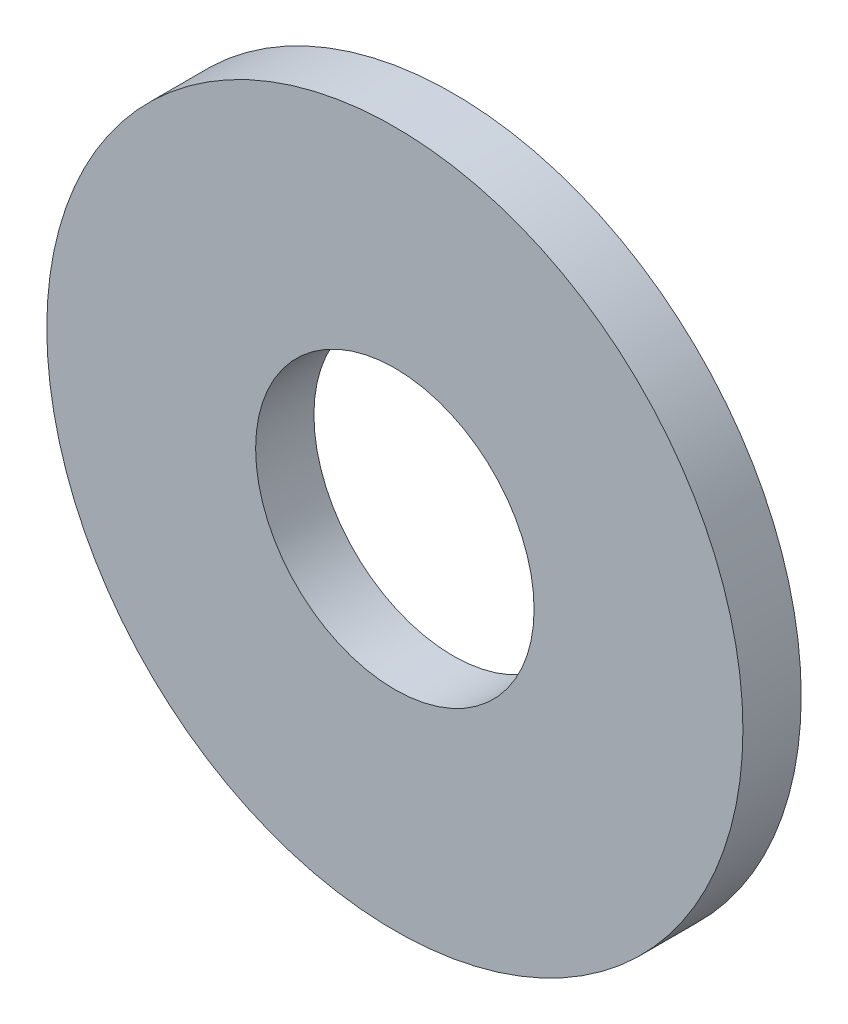
ISO-10303-21;
HEADER;
FILE_DESCRIPTION(('STEP AP214'),'2;1');
FILE_NAME('part.step','',(''),(''),'','','');
FILE_SCHEMA(('AUTOMOTIVE_DESIGN { 1 0 10303 214 1 1 1 1 }'));
ENDSEC;
DATA;
#1=APPLICATION_CONTEXT('core data for automotive mechanical design processes');
#2=APPLICATION_PROTOCOL_DEFINITION('international standard','automotive_design',2000,#1);
#3=PRODUCT_CONTEXT('',#1,'mechanical');
#4=PRODUCT('Part','Part','',(#3));
#5=PRODUCT_RELATED_PRODUCT_CATEGORY('part','',(#4));
#6=PRODUCT_DEFINITION_FORMATION('','',#4);
#7=PRODUCT_DEFINITION_CONTEXT('part definition',#1,'design');
#8=PRODUCT_DEFINITION('design','',#6,#7);
#9=PRODUCT_DEFINITION_SHAPE('','',#8);
#10=(LENGTH_UNIT() NAMED_UNIT(*) SI_UNIT(.MILLI.,.METRE.));
#11=(NAMED_UNIT(*) PLANE_ANGLE_UNIT() SI_UNIT($,.RADIAN.));
#12=(NAMED_UNIT(*) SI_UNIT($,.STERADIAN.) SOLID_ANGLE_UNIT());
#13=UNCERTAINTY_MEASURE_WITH_UNIT(LENGTH_MEASURE(1.E-05),#10,'distance_accuracy_value','');
#14=(GEOMETRIC_REPRESENTATION_CONTEXT(3) GLOBAL_UNCERTAINTY_ASSIGNED_CONTEXT((#13)) GLOBAL_UNIT_ASSIGNED_CONTEXT((#10,
#11,#12)) REPRESENTATION_CONTEXT('',''));
#15=CARTESIAN_POINT('',(0.,0.,0.));
#16=DIRECTION('',(0.,0.,1.));
#17=DIRECTION('',(1.,0.,0.));
#18=AXIS2_PLACEMENT_3D('',#15,#16,#17);
#19=CARTESIAN_POINT('',(0.,0.,-0.67));
#20=DIRECTION('',(0.,0.,1.));
#21=DIRECTION('',(1.,0.,0.));
#22=AXIS2_PLACEMENT_3D('',#19,#20,#21);
#23=CYLINDRICAL_SURFACE('',#22,4.);
#24=CARTESIAN_POINT('',(0.,0.,-0.67));
#25=DIRECTION('',(0.,0.,1.));
#26=DIRECTION('',(1.,0.,0.));
#27=AXIS2_PLACEMENT_3D('',#24,#25,#26);
#28=CIRCLE('',#27,4.);
#29=CARTESIAN_POINT('',(4.,0.,-0.67));
#30=VERTEX_POINT('',#29);
#31=EDGE_CURVE('E10',#30,#30,#28,.T.);
#32=ORIENTED_EDGE('',*,*,#31,.T.);
#33=EDGE_LOOP('',(#32));
#34=FACE_BOUND('',#33,.T.);
#35=CARTESIAN_POINT('',(0.,0.,0.));
#36=DIRECTION('',(0.,0.,1.));
#37=DIRECTION('',(1.,0.,0.));
#38=AXIS2_PLACEMENT_3D('',#35,#36,#37);
#39=CIRCLE('',#38,4.);
#40=CARTESIAN_POINT('',(4.,0.,0.));
#41=VERTEX_POINT('',#40);
#42=EDGE_CURVE('E33',#41,#41,#39,.T.);
#43=ORIENTED_EDGE('',*,*,#42,.F.);
#44=EDGE_LOOP('',(#43));
#45=FACE_BOUND('',#44,.T.);
#46=ADVANCED_FACE('F30',(#34,#45),#23,.T.);
#47=CARTESIAN_POINT('',(0.,0.,-0.67));
#48=DIRECTION('',(0.,0.,1.));
#49=DIRECTION('',(1.,0.,0.));
#50=AXIS2_PLACEMENT_3D('',#47,#48,#49);
#51=PLANE('',#50);
#52=CARTESIAN_POINT('',(0.,0.,-0.67));
#53=DIRECTION('',(0.,0.,1.));
#54=DIRECTION('',(1.,0.,0.));
#55=AXIS2_PLACEMENT_3D('',#52,#53,#54);
#56=CIRCLE('',#55,1.6);
#57=CARTESIAN_POINT('',(1.6,0.,-0.67));
#58=VERTEX_POINT('',#57);
#59=EDGE_CURVE('E40',#58,#58,#56,.T.);
#60=ORIENTED_EDGE('',*,*,#59,.T.);
#61=EDGE_LOOP('',(#60));
#62=FACE_BOUND('',#61,.T.);
#63=ORIENTED_EDGE('',*,*,#31,.F.);
#64=EDGE_LOOP('',(#63));
#65=FACE_BOUND('',#64,.T.);
#66=ADVANCED_FACE('F48',(#62,#65),#51,.F.);
#67=CARTESIAN_POINT('',(0.,0.,0.));
#68=DIRECTION('',(0.,0.,1.));
#69=DIRECTION('',(1.,0.,0.));
#70=AXIS2_PLACEMENT_3D('',#67,#68,#69);
#71=PLANE('',#70);
#72=CARTESIAN_POINT('',(0.,0.,0.));
#73=DIRECTION('',(0.,0.,1.));
#74=DIRECTION('',(1.,0.,0.));
#75=AXIS2_PLACEMENT_3D('',#72,#73,#74);
#76=CIRCLE('',#75,1.6);
#77=CARTESIAN_POINT('',(1.6,0.,0.));
#78=VERTEX_POINT('',#77);
#79=EDGE_CURVE('E42',#78,#78,#76,.T.);
#80=ORIENTED_EDGE('',*,*,#79,.F.);
#81=EDGE_LOOP('',(#80));
#82=FACE_BOUND('',#81,.T.);
#83=ORIENTED_EDGE('',*,*,#42,.T.);
#84=EDGE_LOOP('',(#83));
#85=FACE_BOUND('',#84,.T.);
#86=ADVANCED_FACE('F54',(#82,#85),#71,.T.);
#87=CARTESIAN_POINT('',(0.,0.,-0.67));
#88=DIRECTION('',(0.,0.,1.));
#89=DIRECTION('',(1.,0.,0.));
#90=AXIS2_PLACEMENT_3D('',#87,#88,#89);
#91=CYLINDRICAL_SURFACE('',#90,1.6);
#92=ORIENTED_EDGE('',*,*,#59,.F.);
#93=EDGE_LOOP('',(#92));
#94=FACE_BOUND('',#93,.T.);
#95=ORIENTED_EDGE('',*,*,#79,.T.);
#96=EDGE_LOOP('',(#95));
#97=FACE_BOUND('',#96,.T.);
#98=ADVANCED_FACE('F51',(#94,#97),#91,.F.);
#99=CLOSED_SHELL('',(#46,#66,#86,#98));
#100=MANIFOLD_SOLID_BREP('B2',#99);
#101=ADVANCED_BREP_SHAPE_REPRESENTATION('',(#18,#100),#14);
#102=SHAPE_DEFINITION_REPRESENTATION(#9,#101);
ENDSEC;
END-ISO-10303-21;
